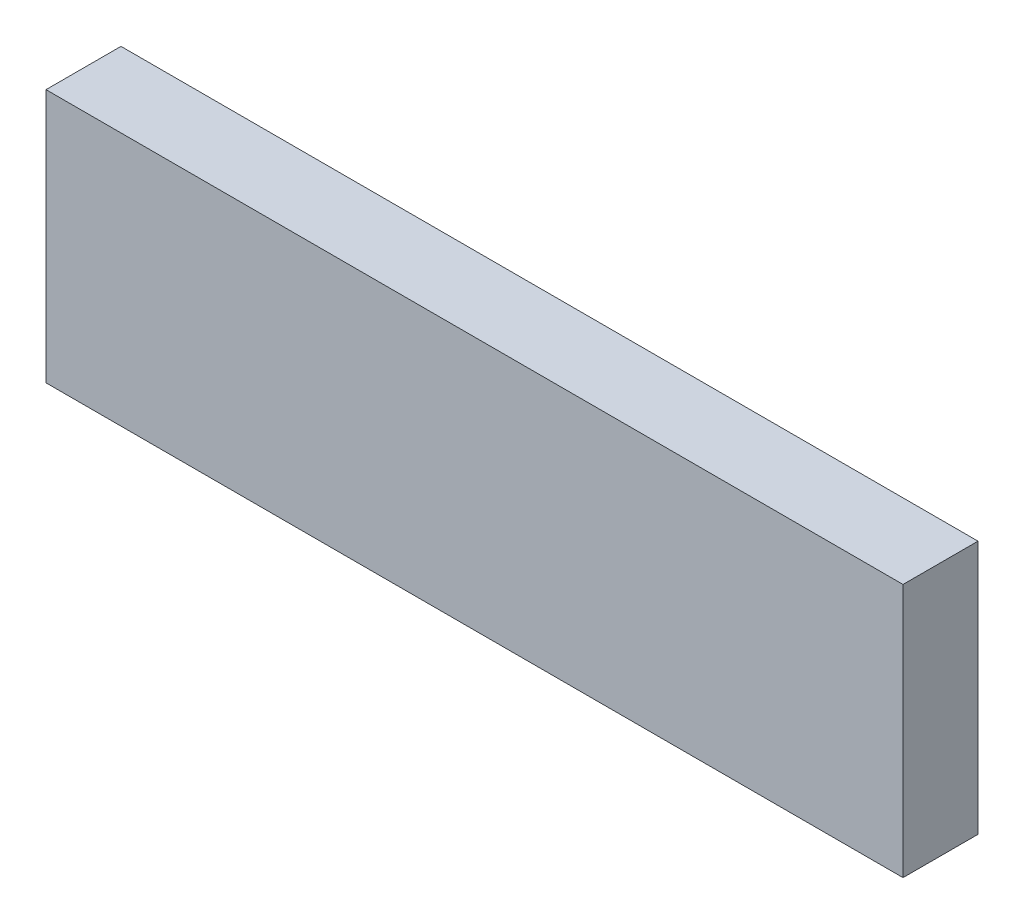
ISO-10303-21;
HEADER;
FILE_DESCRIPTION(('STEP AP214'),'2;1');
FILE_NAME('part.step','',(''),(''),'','','');
FILE_SCHEMA(('AUTOMOTIVE_DESIGN { 1 0 10303 214 1 1 1 1 }'));
ENDSEC;
DATA;
#1=APPLICATION_CONTEXT('core data for automotive mechanical design processes');
#2=APPLICATION_PROTOCOL_DEFINITION('international standard','automotive_design',2000,#1);
#3=PRODUCT_CONTEXT('',#1,'mechanical');
#4=PRODUCT('Part','Part','',(#3));
#5=PRODUCT_RELATED_PRODUCT_CATEGORY('part','',(#4));
#6=PRODUCT_DEFINITION_FORMATION('','',#4);
#7=PRODUCT_DEFINITION_CONTEXT('part definition',#1,'design');
#8=PRODUCT_DEFINITION('design','',#6,#7);
#9=PRODUCT_DEFINITION_SHAPE('','',#8);
#10=(LENGTH_UNIT() NAMED_UNIT(*) SI_UNIT(.MILLI.,.METRE.));
#11=(NAMED_UNIT(*) PLANE_ANGLE_UNIT() SI_UNIT($,.RADIAN.));
#12=(NAMED_UNIT(*) SI_UNIT($,.STERADIAN.) SOLID_ANGLE_UNIT());
#13=UNCERTAINTY_MEASURE_WITH_UNIT(LENGTH_MEASURE(1.E-05),#10,'distance_accuracy_value','');
#14=(GEOMETRIC_REPRESENTATION_CONTEXT(3) GLOBAL_UNCERTAINTY_ASSIGNED_CONTEXT((#13)) GLOBAL_UNIT_ASSIGNED_CONTEXT((#10,
#11,#12)) REPRESENTATION_CONTEXT('',''));
#15=CARTESIAN_POINT('',(0.,0.,0.));
#16=DIRECTION('',(0.,0.,1.));
#17=DIRECTION('',(1.,0.,0.));
#18=AXIS2_PLACEMENT_3D('',#15,#16,#17);
#19=CARTESIAN_POINT('',(-34.29,10.16,3.));
#20=DIRECTION('',(1.,0.,0.));
#21=DIRECTION('',(0.,0.,-1.));
#22=AXIS2_PLACEMENT_3D('',#19,#20,#21);
#23=PLANE('',#22);
#24=DIRECTION('',(0.,-1.,0.));
#25=VECTOR('',#24,1.);
#26=CARTESIAN_POINT('',(-34.29,10.16,0.));
#27=LINE('',#26,#25);
#28=CARTESIAN_POINT('',(-34.29,10.16,0.));
#29=VERTEX_POINT('',#28);
#30=CARTESIAN_POINT('',(-34.29,0.,0.));
#31=VERTEX_POINT('',#30);
#32=EDGE_CURVE('E96',#29,#31,#27,.T.);
#33=ORIENTED_EDGE('',*,*,#32,.T.);
#34=DIRECTION('',(0.,0.,-1.));
#35=VECTOR('',#34,1.);
#36=CARTESIAN_POINT('',(-34.29,0.,3.));
#37=LINE('',#36,#35);
#38=CARTESIAN_POINT('',(-34.29,0.,3.));
#39=VERTEX_POINT('',#38);
#40=EDGE_CURVE('E11',#39,#31,#37,.T.);
#41=ORIENTED_EDGE('',*,*,#40,.F.);
#42=DIRECTION('',(0.,-1.,0.));
#43=VECTOR('',#42,1.);
#44=CARTESIAN_POINT('',(-34.29,10.16,3.));
#45=LINE('',#44,#43);
#46=CARTESIAN_POINT('',(-34.29,10.16,3.));
#47=VERTEX_POINT('',#46);
#48=EDGE_CURVE('E84',#47,#39,#45,.T.);
#49=ORIENTED_EDGE('',*,*,#48,.F.);
#50=DIRECTION('',(0.,0.,-1.));
#51=VECTOR('',#50,1.);
#52=CARTESIAN_POINT('',(-34.29,10.16,3.));
#53=LINE('',#52,#51);
#54=EDGE_CURVE('E92',#47,#29,#53,.T.);
#55=ORIENTED_EDGE('',*,*,#54,.T.);
#56=EDGE_LOOP('',(#33,#41,#49,#55));
#57=FACE_BOUND('',#56,.T.);
#58=ADVANCED_FACE('F33',(#57),#23,.F.);
#59=CARTESIAN_POINT('',(-34.29,0.,3.));
#60=DIRECTION('',(0.,1.,0.));
#61=DIRECTION('',(0.,0.,1.));
#62=AXIS2_PLACEMENT_3D('',#59,#60,#61);
#63=PLANE('',#62);
#64=DIRECTION('',(1.,0.,0.));
#65=VECTOR('',#64,1.);
#66=CARTESIAN_POINT('',(-34.29,0.,0.));
#67=LINE('',#66,#65);
#68=CARTESIAN_POINT('',(0.,0.,0.));
#69=VERTEX_POINT('',#68);
#70=EDGE_CURVE('E88',#31,#69,#67,.T.);
#71=ORIENTED_EDGE('',*,*,#70,.T.);
#72=DIRECTION('',(0.,0.,-1.));
#73=VECTOR('',#72,1.);
#74=CARTESIAN_POINT('',(0.,0.,3.));
#75=LINE('',#74,#73);
#76=CARTESIAN_POINT('',(0.,0.,3.));
#77=VERTEX_POINT('',#76);
#78=EDGE_CURVE('E41',#77,#69,#75,.T.);
#79=ORIENTED_EDGE('',*,*,#78,.F.);
#80=DIRECTION('',(1.,0.,0.));
#81=VECTOR('',#80,1.);
#82=CARTESIAN_POINT('',(-34.29,0.,3.));
#83=LINE('',#82,#81);
#84=EDGE_CURVE('E79',#39,#77,#83,.T.);
#85=ORIENTED_EDGE('',*,*,#84,.F.);
#86=ORIENTED_EDGE('',*,*,#40,.T.);
#87=EDGE_LOOP('',(#71,#79,#85,#86));
#88=FACE_BOUND('',#87,.T.);
#89=ADVANCED_FACE('F87',(#88),#63,.F.);
#90=CARTESIAN_POINT('',(0.,10.16,3.));
#91=DIRECTION('',(-1.,0.,0.));
#92=DIRECTION('',(0.,-1.,0.));
#93=AXIS2_PLACEMENT_3D('',#90,#91,#92);
#94=PLANE('',#93);
#95=DIRECTION('',(0.,1.,0.));
#96=VECTOR('',#95,1.);
#97=CARTESIAN_POINT('',(0.,10.16,0.));
#98=LINE('',#97,#96);
#99=CARTESIAN_POINT('',(0.,10.16,0.));
#100=VERTEX_POINT('',#99);
#101=EDGE_CURVE('E66',#69,#100,#98,.T.);
#102=ORIENTED_EDGE('',*,*,#101,.T.);
#103=DIRECTION('',(0.,0.,-1.));
#104=VECTOR('',#103,1.);
#105=CARTESIAN_POINT('',(0.,10.16,3.));
#106=LINE('',#105,#104);
#107=CARTESIAN_POINT('',(0.,10.16,3.));
#108=VERTEX_POINT('',#107);
#109=EDGE_CURVE('E89',#108,#100,#106,.T.);
#110=ORIENTED_EDGE('',*,*,#109,.F.);
#111=DIRECTION('',(0.,1.,0.));
#112=VECTOR('',#111,1.);
#113=CARTESIAN_POINT('',(0.,10.16,3.));
#114=LINE('',#113,#112);
#115=EDGE_CURVE('E82',#77,#108,#114,.T.);
#116=ORIENTED_EDGE('',*,*,#115,.F.);
#117=ORIENTED_EDGE('',*,*,#78,.T.);
#118=EDGE_LOOP('',(#102,#110,#116,#117));
#119=FACE_BOUND('',#118,.T.);
#120=ADVANCED_FACE('F90',(#119),#94,.F.);
#121=CARTESIAN_POINT('',(-34.29,10.16,3.));
#122=DIRECTION('',(0.,-1.,0.));
#123=DIRECTION('',(1.,0.,0.));
#124=AXIS2_PLACEMENT_3D('',#121,#122,#123);
#125=PLANE('',#124);
#126=DIRECTION('',(-1.,0.,0.));
#127=VECTOR('',#126,1.);
#128=CARTESIAN_POINT('',(-34.29,10.16,0.));
#129=LINE('',#128,#127);
#130=EDGE_CURVE('E72',#100,#29,#129,.T.);
#131=ORIENTED_EDGE('',*,*,#130,.T.);
#132=ORIENTED_EDGE('',*,*,#54,.F.);
#133=DIRECTION('',(-1.,0.,0.));
#134=VECTOR('',#133,1.);
#135=CARTESIAN_POINT('',(-34.29,10.16,3.));
#136=LINE('',#135,#134);
#137=EDGE_CURVE('E49',#108,#47,#136,.T.);
#138=ORIENTED_EDGE('',*,*,#137,.F.);
#139=ORIENTED_EDGE('',*,*,#109,.T.);
#140=EDGE_LOOP('',(#131,#132,#138,#139));
#141=FACE_BOUND('',#140,.T.);
#142=ADVANCED_FACE('F103',(#141),#125,.F.);
#143=CARTESIAN_POINT('',(0.,0.,3.));
#144=DIRECTION('',(0.,0.,1.));
#145=DIRECTION('',(1.,0.,0.));
#146=AXIS2_PLACEMENT_3D('',#143,#144,#145);
#147=PLANE('',#146);
#148=ORIENTED_EDGE('',*,*,#48,.T.);
#149=ORIENTED_EDGE('',*,*,#84,.T.);
#150=ORIENTED_EDGE('',*,*,#115,.T.);
#151=ORIENTED_EDGE('',*,*,#137,.T.);
#152=EDGE_LOOP('',(#148,#149,#150,#151));
#153=FACE_BOUND('',#152,.T.);
#154=ADVANCED_FACE('F80',(#153),#147,.T.);
#155=CARTESIAN_POINT('',(0.,0.,0.));
#156=DIRECTION('',(0.,0.,1.));
#157=DIRECTION('',(1.,0.,0.));
#158=AXIS2_PLACEMENT_3D('',#155,#156,#157);
#159=PLANE('',#158);
#160=ORIENTED_EDGE('',*,*,#32,.F.);
#161=ORIENTED_EDGE('',*,*,#130,.F.);
#162=ORIENTED_EDGE('',*,*,#101,.F.);
#163=ORIENTED_EDGE('',*,*,#70,.F.);
#164=EDGE_LOOP('',(#160,#161,#162,#163));
#165=FACE_BOUND('',#164,.T.);
#166=ADVANCED_FACE('F106',(#165),#159,.F.);
#167=CLOSED_SHELL('',(#58,#89,#120,#142,#154,#166));
#168=MANIFOLD_SOLID_BREP('B2',#167);
#169=ADVANCED_BREP_SHAPE_REPRESENTATION('',(#18,#168),#14);
#170=SHAPE_DEFINITION_REPRESENTATION(#9,#169);
ENDSEC;
END-ISO-10303-21;
